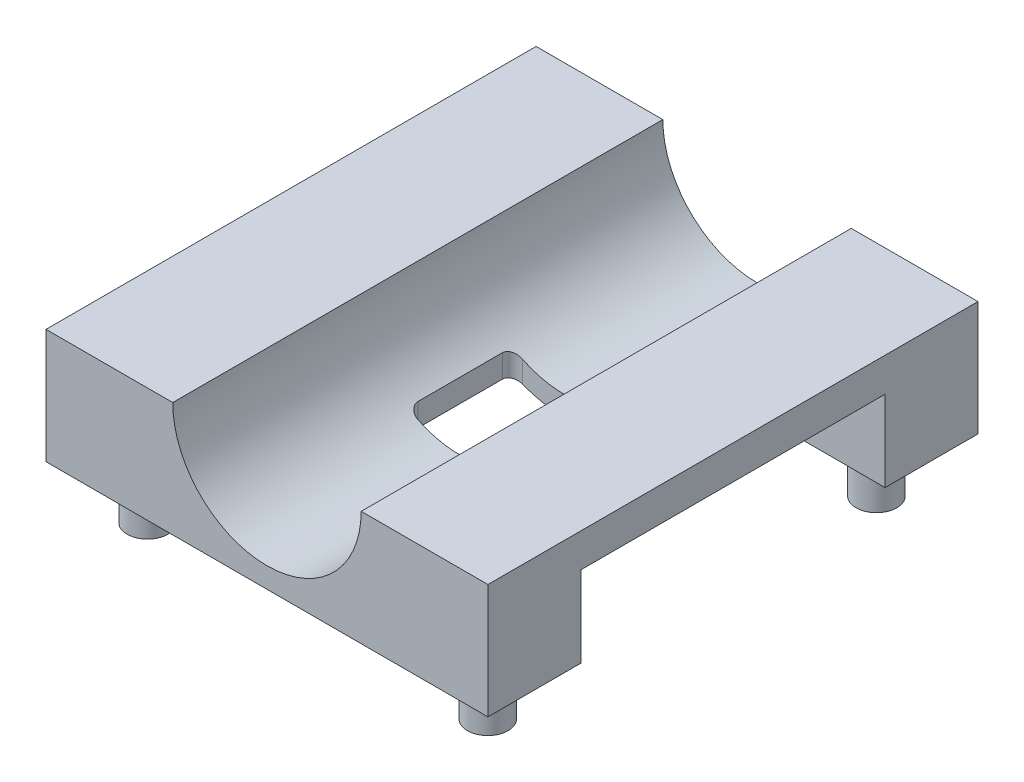
ISO-10303-21;
HEADER;
FILE_DESCRIPTION(('STEP AP214'),'2;1');
FILE_NAME('part.step','',(''),(''),'','','');
FILE_SCHEMA(('AUTOMOTIVE_DESIGN { 1 0 10303 214 1 1 1 1 }'));
ENDSEC;
DATA;
#1=APPLICATION_CONTEXT('core data for automotive mechanical design processes');
#2=APPLICATION_PROTOCOL_DEFINITION('international standard','automotive_design',2000,#1);
#3=PRODUCT_CONTEXT('',#1,'mechanical');
#4=PRODUCT('Part','Part','',(#3));
#5=PRODUCT_RELATED_PRODUCT_CATEGORY('part','',(#4));
#6=PRODUCT_DEFINITION_FORMATION('','',#4);
#7=PRODUCT_DEFINITION_CONTEXT('part definition',#1,'design');
#8=PRODUCT_DEFINITION('design','',#6,#7);
#9=PRODUCT_DEFINITION_SHAPE('','',#8);
#10=(LENGTH_UNIT() NAMED_UNIT(*) SI_UNIT(.MILLI.,.METRE.));
#11=(NAMED_UNIT(*) PLANE_ANGLE_UNIT() SI_UNIT($,.RADIAN.));
#12=(NAMED_UNIT(*) SI_UNIT($,.STERADIAN.) SOLID_ANGLE_UNIT());
#13=UNCERTAINTY_MEASURE_WITH_UNIT(LENGTH_MEASURE(1.E-05),#10,'distance_accuracy_value','');
#14=(GEOMETRIC_REPRESENTATION_CONTEXT(3) GLOBAL_UNCERTAINTY_ASSIGNED_CONTEXT((#13)) GLOBAL_UNIT_ASSIGNED_CONTEXT((#10,
#11,#12)) REPRESENTATION_CONTEXT('',''));
#15=CARTESIAN_POINT('',(0.,0.,0.));
#16=DIRECTION('',(0.,0.,1.));
#17=DIRECTION('',(1.,0.,0.));
#18=AXIS2_PLACEMENT_3D('',#15,#16,#17);
#19=CARTESIAN_POINT('',(13.075,3.1518362466727,-14.5));
#20=DIRECTION('',(0.,1.,0.));
#21=DIRECTION('',(0.,0.,1.));
#22=AXIS2_PLACEMENT_3D('',#19,#20,#21);
#23=PLANE('',#22);
#24=CARTESIAN_POINT('',(-10.105,3.1518362466727,-11.46));
#25=DIRECTION('',(0.,1.,0.));
#26=DIRECTION('',(0.,0.,1.));
#27=AXIS2_PLACEMENT_3D('',#24,#25,#26);
#28=CIRCLE('',#27,1.205);
#29=CARTESIAN_POINT('',(-10.105,3.1518362466727,-10.255));
#30=VERTEX_POINT('',#29);
#31=EDGE_CURVE('E425',#30,#30,#28,.F.);
#32=ORIENTED_EDGE('',*,*,#31,.F.);
#33=EDGE_LOOP('',(#32));
#34=FACE_BOUND('',#33,.T.);
#35=CARTESIAN_POINT('',(10.105,3.1518362466727,-11.46));
#36=DIRECTION('',(0.,1.,0.));
#37=DIRECTION('',(0.,0.,1.));
#38=AXIS2_PLACEMENT_3D('',#35,#36,#37);
#39=CIRCLE('',#38,1.205);
#40=CARTESIAN_POINT('',(10.105,3.1518362466727,-10.255));
#41=VERTEX_POINT('',#40);
#42=EDGE_CURVE('E428',#41,#41,#39,.F.);
#43=ORIENTED_EDGE('',*,*,#42,.F.);
#44=EDGE_LOOP('',(#43));
#45=FACE_BOUND('',#44,.T.);
#46=DIRECTION('',(1.,0.,0.));
#47=VECTOR('',#46,1.);
#48=CARTESIAN_POINT('',(-13.075,3.1518362466727,-9.));
#49=LINE('',#48,#47);
#50=CARTESIAN_POINT('',(-13.075,3.1518362466727,-9.));
#51=VERTEX_POINT('',#50);
#52=CARTESIAN_POINT('',(13.075,3.1518362466727,-9.));
#53=VERTEX_POINT('',#52);
#54=EDGE_CURVE('E54',#51,#53,#49,.T.);
#55=ORIENTED_EDGE('',*,*,#54,.F.);
#56=DIRECTION('',(0.,0.,1.));
#57=VECTOR('',#56,1.);
#58=CARTESIAN_POINT('',(-13.075,3.1518362466727,-14.5));
#59=LINE('',#58,#57);
#60=CARTESIAN_POINT('',(-13.075,3.1518362466727,-14.5));
#61=VERTEX_POINT('',#60);
#62=EDGE_CURVE('E410',#61,#51,#59,.T.);
#63=ORIENTED_EDGE('',*,*,#62,.F.);
#64=DIRECTION('',(-1.,0.,0.));
#65=VECTOR('',#64,1.);
#66=CARTESIAN_POINT('',(13.075,3.1518362466727,-14.5));
#67=LINE('',#66,#65);
#68=CARTESIAN_POINT('',(13.075,3.1518362466727,-14.5));
#69=VERTEX_POINT('',#68);
#70=EDGE_CURVE('E407',#69,#61,#67,.T.);
#71=ORIENTED_EDGE('',*,*,#70,.F.);
#72=DIRECTION('',(0.,0.,1.));
#73=VECTOR('',#72,1.);
#74=CARTESIAN_POINT('',(13.075,3.1518362466727,-14.5));
#75=LINE('',#74,#73);
#76=EDGE_CURVE('E414',#69,#53,#75,.T.);
#77=ORIENTED_EDGE('',*,*,#76,.T.);
#78=EDGE_LOOP('',(#55,#63,#71,#77));
#79=FACE_BOUND('',#78,.T.);
#80=ADVANCED_FACE('F33',(#34,#45,#79),#23,.F.);
#81=CARTESIAN_POINT('',(-3.04509723372467,-0.0642501067480324,-14.5));
#82=DIRECTION('',(-1.,0.,0.));
#83=DIRECTION('',(0.,0.,1.));
#84=AXIS2_PLACEMENT_3D('',#81,#82,#83);
#85=PLANE('',#84);
#86=DIRECTION('',(0.,0.,-1.));
#87=VECTOR('',#86,1.);
#88=CARTESIAN_POINT('',(-3.04509723372467,3.9080780868161,9.));
#89=LINE('',#88,#87);
#90=CARTESIAN_POINT('',(-3.04509723372467,3.9080780868161,-2.47741560380553));
#91=VERTEX_POINT('',#90);
#92=CARTESIAN_POINT('',(-3.04509723372467,3.9080780868161,2.51686965000823));
#93=VERTEX_POINT('',#92);
#94=EDGE_CURVE('E62',#91,#93,#89,.F.);
#95=ORIENTED_EDGE('',*,*,#94,.F.);
#96=DIRECTION('',(0.,1.,0.));
#97=VECTOR('',#96,1.);
#98=CARTESIAN_POINT('',(-3.04509723372467,-0.0642501067480324,-2.47741560380554));
#99=LINE('',#98,#97);
#100=CARTESIAN_POINT('',(-3.04509723372467,5.2658454148753,-2.47741560380554));
#101=VERTEX_POINT('',#100);
#102=EDGE_CURVE('E315',#91,#101,#99,.T.);
#103=ORIENTED_EDGE('',*,*,#102,.T.);
#104=DIRECTION('',(0.,0.,1.));
#105=VECTOR('',#104,1.);
#106=CARTESIAN_POINT('',(-3.04509723372467,5.2658454148753,-14.5));
#107=LINE('',#106,#105);
#108=CARTESIAN_POINT('',(-3.04509723372467,5.2658454148753,2.51686965000823));
#109=VERTEX_POINT('',#108);
#110=EDGE_CURVE('E359',#109,#101,#107,.F.);
#111=ORIENTED_EDGE('',*,*,#110,.F.);
#112=DIRECTION('',(0.,1.,0.));
#113=VECTOR('',#112,1.);
#114=CARTESIAN_POINT('',(-3.04509723372467,-0.0642501067480324,2.51686965000823));
#115=LINE('',#114,#113);
#116=EDGE_CURVE('E336',#93,#109,#115,.T.);
#117=ORIENTED_EDGE('',*,*,#116,.F.);
#118=EDGE_LOOP('',(#95,#103,#111,#117));
#119=FACE_BOUND('',#118,.T.);
#120=ADVANCED_FACE('F485',(#119),#85,.F.);
#121=CARTESIAN_POINT('',(-2.44509723372467,-0.0642501067480324,-2.47741560380554));
#122=DIRECTION('',(0.,1.,0.));
#123=DIRECTION('',(0.,0.,1.));
#124=AXIS2_PLACEMENT_3D('',#121,#122,#123);
#125=CYLINDRICAL_SURFACE('',#124,0.6);
#126=ORIENTED_EDGE('',*,*,#102,.F.);
#127=CARTESIAN_POINT('',(-3.04509723372467,3.9080780868161,-2.47741560380553));
#128=CARTESIAN_POINT('',(-3.04513505100854,3.90810422093181,-2.50873542246588));
#129=CARTESIAN_POINT('',(-3.04264767860765,3.90684059379633,-2.54002143175839));
#130=CARTESIAN_POINT('',(-3.03293029615708,3.90194265067985,-2.6015343220606));
#131=CARTESIAN_POINT('',(-3.02571919260857,3.89831778575885,-2.63176492135539));
#132=CARTESIAN_POINT('',(-3.00686507969512,3.88890687623194,-2.690415613318));
#133=CARTESIAN_POINT('',(-2.99522552396408,3.88312251582576,-2.71883709675656));
#134=CARTESIAN_POINT('',(-2.96798035700584,3.86971587889807,-2.7732524350038));
#135=CARTESIAN_POINT('',(-2.95237170533693,3.8620921936311,-2.79924440776849));
#136=CARTESIAN_POINT('',(-2.91686796757146,3.84495920216646,-2.84946909456308));
#137=CARTESIAN_POINT('',(-2.89680163677029,3.83537634802099,-2.87355523977421));
#138=CARTESIAN_POINT('',(-2.85349088794498,3.81499770648591,-2.91807423054141));
#139=CARTESIAN_POINT('',(-2.83024537318453,3.80420150075146,-2.93850580972856));
#140=CARTESIAN_POINT('',(-2.77870752645528,3.78066194716055,-2.97726018506469));
#141=CARTESIAN_POINT('',(-2.75014301871532,3.76783182042962,-2.99516857229988));
#142=CARTESIAN_POINT('',(-2.69062347560449,3.74163584220398,-3.02590390428281));
#143=CARTESIAN_POINT('',(-2.65966780957357,3.72826984982664,-3.03872950295629));
#144=CARTESIAN_POINT('',(-2.59842503841266,3.70240017471671,-3.05831743686993));
#145=CARTESIAN_POINT('',(-2.56825330165747,3.68990454768406,-3.06545318169207));
#146=CARTESIAN_POINT('',(-2.50712151136663,3.66511215666269,-3.07500369946481));
#147=CARTESIAN_POINT('',(-2.47616209643355,3.65281524401326,-3.0774221806384));
#148=CARTESIAN_POINT('',(-2.44509723372467,3.64075632005657,-3.07741560380554));
#149=B_SPLINE_CURVE_WITH_KNOTS('',3,(#127,#128,#129,#130,#131,#132,#133,#134,#135,#136,#137,
#138,#139,#140,#141,#142,#143,#144,#145,#146,#147,#148),.UNSPECIFIED.,.F.,.F.,(4,2,2,2,2,2,2,2,
2,2,4),(0.,0.0937824186535617,0.18719175258634,0.280528387853621,0.373936738195387,
0.471877687810948,0.569852510150105,0.677612391961076,0.785400792767965,0.885342772786439,
0.985206157081653),.UNSPECIFIED.);
#150=CARTESIAN_POINT('',(-2.44509723372467,3.64075632005657,-3.07741560380554));
#151=VERTEX_POINT('',#150);
#152=EDGE_CURVE('E338',#91,#151,#149,.T.);
#153=ORIENTED_EDGE('',*,*,#152,.T.);
#154=DIRECTION('',(0.,1.,0.));
#155=VECTOR('',#154,1.);
#156=CARTESIAN_POINT('',(-2.44509723372467,-0.0642501067480324,-3.07741560380554));
#157=LINE('',#156,#155);
#158=CARTESIAN_POINT('',(-2.44509723372467,4.92554784965811,-3.07741560380554));
#159=VERTEX_POINT('',#158);
#160=EDGE_CURVE('E318',#151,#159,#157,.T.);
#161=ORIENTED_EDGE('',*,*,#160,.T.);
#162=CARTESIAN_POINT('',(-2.44509723372467,4.92554784965811,-3.07741560380554));
#163=CARTESIAN_POINT('',(-2.48300653858772,4.9440286146171,-3.07741720750608));
#164=CARTESIAN_POINT('',(-2.52067135893824,4.96296176550388,-3.07382426608874));
#165=CARTESIAN_POINT('',(-2.59458004756904,5.00113155262164,-3.05971359453192));
#166=CARTESIAN_POINT('',(-2.63082224676885,5.02036851026287,-3.04918797367395));
#167=CARTESIAN_POINT('',(-2.70086552357556,5.0585011125975,-3.0214764041093));
#168=CARTESIAN_POINT('',(-2.73466641225009,5.07739673079005,-3.00428994057559));
#169=CARTESIAN_POINT('',(-2.79886471367591,5.11409617139655,-2.96351606727367));
#170=CARTESIAN_POINT('',(-2.82926174623108,5.1318998717477,-2.93992794347285));
#171=CARTESIAN_POINT('',(-2.88476999188179,5.16503245736171,-2.8874244756521));
#172=CARTESIAN_POINT('',(-2.91000472372295,5.18041640991648,-2.85867557824696));
#173=CARTESIAN_POINT('',(-2.955011883936,5.20825256579134,-2.79595690208967));
#174=CARTESIAN_POINT('',(-2.97479463910791,5.22071030505909,-2.76199718605209));
#175=CARTESIAN_POINT('',(-3.00314144903064,5.23873299484613,-2.69971969845568));
#176=CARTESIAN_POINT('',(-3.01329379560715,5.24525120849709,-2.67239190678026));
#177=CARTESIAN_POINT('',(-3.02957414075903,5.25574981173803,-2.61612162427177));
#178=CARTESIAN_POINT('',(-3.03571070642021,5.25973560335052,-2.58718271468676));
#179=CARTESIAN_POINT('',(-3.04148063511723,5.26348872929292,-2.54455830693254));
#180=CARTESIAN_POINT('',(-3.04283525142465,5.26437105419791,-2.53117869023291));
#181=CARTESIAN_POINT('',(-3.04464343017526,5.26554945941841,-2.50434025397009));
#182=CARTESIAN_POINT('',(-3.04509746973639,5.26584585015661,-2.49088148013652));
#183=CARTESIAN_POINT('',(-3.04509723372471,5.26584541487513,-2.47741560380553));
#184=B_SPLINE_CURVE_WITH_KNOTS('',3,(#162,#163,#164,#165,#166,#167,#168,#169,#170,#171,#172,
#173,#174,#175,#176,#177,#178,#179,#180,#181,#182,#183),.UNSPECIFIED.,.F.,.F.,(4,2,2,2,2,2,2,2,
2,2,4),(0.,0.126341091013564,0.252826231488759,0.379321150149909,0.505830183687303,
0.628819978592956,0.751575187102049,0.840825389762778,0.929884563925778,0.970278822445095,
1.01065167470571),.UNSPECIFIED.);
#185=EDGE_CURVE('E358',#159,#101,#184,.T.);
#186=ORIENTED_EDGE('',*,*,#185,.T.);
#187=EDGE_LOOP('',(#126,#153,#161,#186));
#188=FACE_BOUND('',#187,.T.);
#189=ADVANCED_FACE('F247',(#188),#125,.F.);
#190=CARTESIAN_POINT('',(-13.075,-0.0642501067480324,-3.07741560380554));
#191=DIRECTION('',(0.,0.,1.));
#192=DIRECTION('',(1.,0.,0.));
#193=AXIS2_PLACEMENT_3D('',#190,#191,#192);
#194=PLANE('',#193);
#195=ORIENTED_EDGE('',*,*,#160,.F.);
#196=CARTESIAN_POINT('',(0.,9.93574989325197,-3.07741560380554));
#197=DIRECTION('',(0.,0.,1.));
#198=DIRECTION('',(1.,0.,0.));
#199=AXIS2_PLACEMENT_3D('',#196,#197,#198);
#200=CIRCLE('',#199,6.75318032995857);
#201=CARTESIAN_POINT('',(2.39137183527856,3.62015132190691,-3.07741560380554));
#202=VERTEX_POINT('',#201);
#203=EDGE_CURVE('E262',#151,#202,#200,.T.);
#204=ORIENTED_EDGE('',*,*,#203,.T.);
#205=DIRECTION('',(0.,1.,0.));
#206=VECTOR('',#205,1.);
#207=CARTESIAN_POINT('',(2.39137183527856,-0.0642501067480324,-3.07741560380554));
#208=LINE('',#207,#206);
#209=CARTESIAN_POINT('',(2.39137183527856,4.8996833979169,-3.07741560380554));
#210=VERTEX_POINT('',#209);
#211=EDGE_CURVE('E324',#202,#210,#208,.T.);
#212=ORIENTED_EDGE('',*,*,#211,.T.);
#213=CARTESIAN_POINT('',(0.,9.93574989325197,-3.07741560380554));
#214=DIRECTION('',(0.,0.,1.));
#215=DIRECTION('',(1.,0.,0.));
#216=AXIS2_PLACEMENT_3D('',#213,#214,#215);
#217=CIRCLE('',#216,5.575);
#218=EDGE_CURVE('E280',#210,#159,#217,.F.);
#219=ORIENTED_EDGE('',*,*,#218,.T.);
#220=EDGE_LOOP('',(#195,#204,#212,#219));
#221=FACE_BOUND('',#220,.T.);
#222=ADVANCED_FACE('F267',(#221),#194,.T.);
#223=CARTESIAN_POINT('',(2.39137183527856,-0.0642501067480324,-2.47741560380554));
#224=DIRECTION('',(0.,1.,0.));
#225=DIRECTION('',(0.,0.,1.));
#226=AXIS2_PLACEMENT_3D('',#223,#224,#225);
#227=CYLINDRICAL_SURFACE('',#226,0.6);
#228=ORIENTED_EDGE('',*,*,#211,.F.);
#229=CARTESIAN_POINT('',(2.39137183527856,3.62015132190691,-3.07741560380554));
#230=CARTESIAN_POINT('',(2.42763334414463,3.63386807840735,-3.07742957560648));
#231=CARTESIAN_POINT('',(2.46375365430434,3.64791496614628,-3.07412986564736));
#232=CARTESIAN_POINT('',(2.53476728686477,3.67621192264573,-3.06114200874914));
#233=CARTESIAN_POINT('',(2.56966001373208,3.69046208543466,-3.05145080494139));
#234=CARTESIAN_POINT('',(2.63724798320311,3.71869894000153,-3.02591531318924));
#235=CARTESIAN_POINT('',(2.66994252993061,3.73268554734678,-3.01006908741318));
#236=CARTESIAN_POINT('',(2.73218290621409,3.75984743857264,-2.97255890418401));
#237=CARTESIAN_POINT('',(2.76172949006539,3.77302291649016,-2.95089634480366));
#238=CARTESIAN_POINT('',(2.8162514277176,3.79774895099371,-2.90259948267919));
#239=CARTESIAN_POINT('',(2.84129553221012,3.80932318447142,-2.87605528680823));
#240=CARTESIAN_POINT('',(2.88645388092285,3.83046924222881,-2.81834616610662));
#241=CARTESIAN_POINT('',(2.90656941381143,3.84004158984339,-2.78718245256409));
#242=CARTESIAN_POINT('',(2.93952317433865,3.85586860994002,-2.72379429200529));
#243=CARTESIAN_POINT('',(2.95281766722834,3.86232867411596,-2.69185838281739));
#244=CARTESIAN_POINT('',(2.97375732772188,3.87255349908247,-2.62580877404026));
#245=CARTESIAN_POINT('',(2.98141506190433,3.87632425482433,-2.59170010413997));
#246=CARTESIAN_POINT('',(2.98782288108357,3.87948358922535,-2.54393710361735));
#247=CARTESIAN_POINT('',(2.98915325387299,3.88014022772818,-2.53066762231387));
#248=CARTESIAN_POINT('',(2.99092682156053,3.88101602202,-2.5040731303545));
#249=CARTESIAN_POINT('',(2.99137120971794,3.88123576622461,-2.49074821863949));
#250=CARTESIAN_POINT('',(2.99137183527857,3.88123594809982,-2.47741560380554));
#251=B_SPLINE_CURVE_WITH_KNOTS('',3,(#229,#230,#231,#232,#233,#234,#235,#236,#237,#238,#239,
#240,#241,#242,#243,#244,#245,#246,#247,#248,#249,#250),.UNSPECIFIED.,.F.,.F.,(4,2,2,2,2,2,2,2,
2,2,4),(0.,0.116146796863037,0.232349183739063,0.348588185175548,0.464799271205039,
0.579048481057129,0.693267786334209,0.798269907534175,0.90303722228244,0.943064557543855,
0.983037946787917),.UNSPECIFIED.);
#252=CARTESIAN_POINT('',(2.99137183527856,3.88123594809985,-2.47741560380554));
#253=VERTEX_POINT('',#252);
#254=EDGE_CURVE('E254',#202,#253,#251,.T.);
#255=ORIENTED_EDGE('',*,*,#254,.T.);
#256=DIRECTION('',(0.,1.,0.));
#257=VECTOR('',#256,1.);
#258=CARTESIAN_POINT('',(2.99137183527856,-0.0642501067480324,-2.47741560380554));
#259=LINE('',#258,#257);
#260=CARTESIAN_POINT('',(2.99137183527856,5.23124996838193,-2.47741560380554));
#261=VERTEX_POINT('',#260);
#262=EDGE_CURVE('E329',#253,#261,#259,.T.);
#263=ORIENTED_EDGE('',*,*,#262,.T.);
#264=CARTESIAN_POINT('',(2.99137183527856,5.23124996838193,-2.47741560380554));
#265=CARTESIAN_POINT('',(2.99141248670441,5.23128430213802,-2.50766694784893));
#266=CARTESIAN_POINT('',(2.98908704122792,5.22979708099143,-2.53787265892649));
#267=CARTESIAN_POINT('',(2.98004465900356,5.22406146548978,-2.5971906608469));
#268=CARTESIAN_POINT('',(2.97335126528078,5.21982787465235,-2.626307933783));
#269=CARTESIAN_POINT('',(2.95591943046643,5.20888370937752,-2.68274886490848));
#270=CARTESIAN_POINT('',(2.94518664798818,5.20217660025312,-2.71007496968491));
#271=CARTESIAN_POINT('',(2.92015375522904,5.18669264471618,-2.7624282533839));
#272=CARTESIAN_POINT('',(2.90584946922386,5.17791337624159,-2.78745269405396));
#273=CARTESIAN_POINT('',(2.87310847523787,5.15806616059515,-2.83637842968677));
#274=CARTESIAN_POINT('',(2.85445760452896,5.14688352862458,-2.86008907876907));
#275=CARTESIAN_POINT('',(2.81425162809436,5.12314576435093,-2.90410300230363));
#276=CARTESIAN_POINT('',(2.7926955583258,5.11059017671694,-2.9244051406537));
#277=CARTESIAN_POINT('',(2.74383745397135,5.08261862332918,-2.96413919945146));
#278=CARTESIAN_POINT('',(2.71615682935011,5.06705385993209,-2.98300150686176));
#279=CARTESIAN_POINT('',(2.65834979245887,5.03525053610873,-3.01577252074311));
#280=CARTESIAN_POINT('',(2.62822187296248,5.01901156351012,-3.02967814567945));
#281=CARTESIAN_POINT('',(2.56435517549066,4.98538903230644,-3.05300067215539));
#282=CARTESIAN_POINT('',(2.53050825524829,4.96799420402898,-3.06210646822235));
#283=CARTESIAN_POINT('',(2.46163082103502,4.93349819043173,-3.07431416353491));
#284=CARTESIAN_POINT('',(2.42660098815756,4.91639684440717,-3.07741945971873));
#285=CARTESIAN_POINT('',(2.39137183527856,4.8996833979169,-3.07741560380554));
#286=B_SPLINE_CURVE_WITH_KNOTS('',3,(#264,#265,#266,#267,#268,#269,#270,#271,#272,#273,#274,
#275,#276,#277,#278,#279,#280,#281,#282,#283,#284,#285),.UNSPECIFIED.,.F.,.F.,(4,2,2,2,2,2,2,2,
2,2,4),(0.,0.0905563797058464,0.180628652137533,0.270575212867955,0.360627433688729,
0.456774485974419,0.552953522006567,0.663312760101185,0.773740488585856,0.890644965091383,
1.00748324148537),.UNSPECIFIED.);
#287=EDGE_CURVE('E271',#261,#210,#286,.T.);
#288=ORIENTED_EDGE('',*,*,#287,.T.);
#289=EDGE_LOOP('',(#228,#255,#263,#288));
#290=FACE_BOUND('',#289,.T.);
#291=ADVANCED_FACE('F263',(#290),#227,.F.);
#292=CARTESIAN_POINT('',(2.99137183527856,-0.0642501067480324,-14.5));
#293=DIRECTION('',(-1.,0.,0.));
#294=DIRECTION('',(0.,0.,1.));
#295=AXIS2_PLACEMENT_3D('',#292,#293,#294);
#296=PLANE('',#295);
#297=ORIENTED_EDGE('',*,*,#262,.F.);
#298=DIRECTION('',(0.,0.,-1.));
#299=VECTOR('',#298,1.);
#300=CARTESIAN_POINT('',(2.99137183527856,3.88123594809985,9.));
#301=LINE('',#300,#299);
#302=CARTESIAN_POINT('',(2.99137183527856,3.88123594809985,2.51686965000823));
#303=VERTEX_POINT('',#302);
#304=EDGE_CURVE('E235',#253,#303,#301,.F.);
#305=ORIENTED_EDGE('',*,*,#304,.T.);
#306=DIRECTION('',(0.,1.,0.));
#307=VECTOR('',#306,1.);
#308=CARTESIAN_POINT('',(2.99137183527856,-0.0642501067480324,2.51686965000823));
#309=LINE('',#308,#307);
#310=CARTESIAN_POINT('',(2.99137183527856,5.23124996838193,2.51686965000823));
#311=VERTEX_POINT('',#310);
#312=EDGE_CURVE('E331',#303,#311,#309,.T.);
#313=ORIENTED_EDGE('',*,*,#312,.T.);
#314=DIRECTION('',(0.,0.,1.));
#315=VECTOR('',#314,1.);
#316=CARTESIAN_POINT('',(2.99137183527856,5.23124996838193,-14.5));
#317=LINE('',#316,#315);
#318=EDGE_CURVE('E281',#311,#261,#317,.F.);
#319=ORIENTED_EDGE('',*,*,#318,.T.);
#320=EDGE_LOOP('',(#297,#305,#313,#319));
#321=FACE_BOUND('',#320,.T.);
#322=ADVANCED_FACE('F266',(#321),#296,.T.);
#323=CARTESIAN_POINT('',(2.39137183527856,-0.0642501067480324,2.51686965000823));
#324=DIRECTION('',(0.,1.,0.));
#325=DIRECTION('',(0.,0.,1.));
#326=AXIS2_PLACEMENT_3D('',#323,#324,#325);
#327=CYLINDRICAL_SURFACE('',#326,0.6);
#328=ORIENTED_EDGE('',*,*,#312,.F.);
#329=CARTESIAN_POINT('',(2.99137183527856,3.88123594809985,2.51686965000823));
#330=CARTESIAN_POINT('',(2.99140938227915,3.88126153326827,2.5482806171982));
#331=CARTESIAN_POINT('',(2.98890795846205,3.88001860652077,2.57965863905268));
#332=CARTESIAN_POINT('',(2.97913201712646,3.87519969785145,2.64135794387782));
#333=CARTESIAN_POINT('',(2.97187601489893,3.8716327663792,2.67168284749369));
#334=CARTESIAN_POINT('',(2.95289852929619,3.86237037183736,2.73052012557278));
#335=CARTESIAN_POINT('',(2.9411803239938,3.85667647136345,2.7590338127124));
#336=CARTESIAN_POINT('',(2.91374263755211,3.84347764501758,2.81362252019478));
#337=CARTESIAN_POINT('',(2.89802021320581,3.83597138722685,2.83969572735906));
#338=CARTESIAN_POINT('',(2.86227453685133,3.81911389516413,2.89002915004321));
#339=CARTESIAN_POINT('',(2.84208392023158,3.80969254585984,2.9141466248631));
#340=CARTESIAN_POINT('',(2.79849849083639,3.78965957444604,2.95870690804757));
#341=CARTESIAN_POINT('',(2.77510256978207,3.77904754087153,2.97914843972502));
#342=CARTESIAN_POINT('',(2.72332308017674,3.75595760484121,3.01781877275745));
#343=CARTESIAN_POINT('',(2.69467632062719,3.74339837727728,3.03564684146162));
#344=CARTESIAN_POINT('',(2.63499294953646,3.71776685499894,3.06620873913333));
#345=CARTESIAN_POINT('',(2.60395580338126,3.70469444583299,3.07894142454138));
#346=CARTESIAN_POINT('',(2.54294764868284,3.67956494317659,3.09821196939948));
#347=CARTESIAN_POINT('',(2.51310953291363,3.667515787168,3.105183696366));
#348=CARTESIAN_POINT('',(2.45267140236949,3.64361784451893,3.11451401681426));
#349=CARTESIAN_POINT('',(2.42207200945041,3.63176890680766,3.11687625790633));
#350=CARTESIAN_POINT('',(2.39137183527856,3.62015132190691,3.11686965000823));
#351=B_SPLINE_CURVE_WITH_KNOTS('',3,(#329,#330,#331,#332,#333,#334,#335,#336,#337,#338,#339,
#340,#341,#342,#343,#344,#345,#346,#347,#348,#349,#350),.UNSPECIFIED.,.F.,.F.,(4,2,2,2,2,2,2,2,
2,2,4),(0.,0.0940573233572309,0.187750528004281,0.281375035090994,0.375068558283783,
0.47316423496715,0.571293915610081,0.678842788585064,0.786415785290179,0.884863725269389,
0.983233729098482),.UNSPECIFIED.);
#352=CARTESIAN_POINT('',(2.39137183527856,3.62015132190691,3.11686965000823));
#353=VERTEX_POINT('',#352);
#354=EDGE_CURVE('E227',#303,#353,#351,.T.);
#355=ORIENTED_EDGE('',*,*,#354,.T.);
#356=DIRECTION('',(0.,1.,0.));
#357=VECTOR('',#356,1.);
#358=CARTESIAN_POINT('',(2.39137183527856,-0.0642501067480324,3.11686965000823));
#359=LINE('',#358,#357);
#360=CARTESIAN_POINT('',(2.39137183527856,4.8996833979169,3.11686965000823));
#361=VERTEX_POINT('',#360);
#362=EDGE_CURVE('E333',#353,#361,#359,.T.);
#363=ORIENTED_EDGE('',*,*,#362,.T.);
#364=CARTESIAN_POINT('',(2.39137183527856,4.8996833979169,3.11686965000823));
#365=CARTESIAN_POINT('',(2.42907890871964,4.91756920233117,3.11687279876096));
#366=CARTESIAN_POINT('',(2.46655095706587,4.93590037131668,3.11331656257605));
#367=CARTESIAN_POINT('',(2.54009396378089,4.97286853827507,3.09934946487906));
#368=CARTESIAN_POINT('',(2.57616335564515,4.99150584688886,3.08893116008305));
#369=CARTESIAN_POINT('',(2.64588877529712,5.02846250810962,3.06150329840153));
#370=CARTESIAN_POINT('',(2.67954446124577,5.04678181540255,3.04449281007953));
#371=CARTESIAN_POINT('',(2.7434779617375,5.08237083084865,3.00415689034708));
#372=CARTESIAN_POINT('',(2.77375616189992,5.09964065872183,2.98083218089746));
#373=CARTESIAN_POINT('',(2.82914064955387,5.13183589614511,2.92889216401954));
#374=CARTESIAN_POINT('',(2.8543606116877,5.14681045464289,2.90042958909087));
#375=CARTESIAN_POINT('',(2.8994293133198,5.17396153248168,2.83834104303599));
#376=CARTESIAN_POINT('',(2.91928228218249,5.18614025388463,2.80471917055217));
#377=CARTESIAN_POINT('',(2.95023384409975,5.2053128028922,2.73789215943203));
#378=CARTESIAN_POINT('',(2.96213057369218,5.21277236309467,2.70519093818732));
#379=CARTESIAN_POINT('',(2.98011142612991,5.22409653554995,2.63768211839177));
#380=CARTESIAN_POINT('',(2.98621489173714,5.22797310966187,2.60288194483332));
#381=CARTESIAN_POINT('',(2.98992943701891,5.23033315127548,2.55931997792807));
#382=CARTESIAN_POINT('',(2.99047030230915,5.23067686477349,2.55083738271637));
#383=CARTESIAN_POINT('',(2.9911908626956,5.23113484457447,2.53386114494688));
#384=CARTESIAN_POINT('',(2.99137100196418,5.23124939305477,2.5253675288773));
#385=CARTESIAN_POINT('',(2.99137183527857,5.23124996838192,2.51686965000823));
#386=B_SPLINE_CURVE_WITH_KNOTS('',3,(#364,#365,#366,#367,#368,#369,#370,#371,#372,#373,#374,
#375,#376,#377,#378,#379,#380,#381,#382,#383,#384,#385),.UNSPECIFIED.,.F.,.F.,(4,2,2,2,2,2,2,2,
2,2,4),(0.,0.12502208303728,0.250180001318674,0.375355610124422,0.500516912534773,
0.622435390109001,0.744257510047151,0.850391531870256,0.956169929919554,0.981683813077274,
1.0071662608889),.UNSPECIFIED.);
#387=EDGE_CURVE('E303',#361,#311,#386,.T.);
#388=ORIENTED_EDGE('',*,*,#387,.T.);
#389=EDGE_LOOP('',(#328,#355,#363,#388));
#390=FACE_BOUND('',#389,.T.);
#391=ADVANCED_FACE('F237',(#390),#327,.F.);
#392=CARTESIAN_POINT('',(-13.075,-0.0642501067480324,3.11686965000823));
#393=DIRECTION('',(0.,0.,1.));
#394=DIRECTION('',(1.,0.,0.));
#395=AXIS2_PLACEMENT_3D('',#392,#393,#394);
#396=PLANE('',#395);
#397=CARTESIAN_POINT('',(0.,9.93574989325197,3.11686965000823));
#398=DIRECTION('',(0.,0.,1.));
#399=DIRECTION('',(1.,0.,0.));
#400=AXIS2_PLACEMENT_3D('',#397,#398,#399);
#401=CIRCLE('',#400,6.75318032995857);
#402=CARTESIAN_POINT('',(-2.44509723372466,3.64075632005657,3.11686965000823));
#403=VERTEX_POINT('',#402);
#404=EDGE_CURVE('E186',#403,#353,#401,.T.);
#405=ORIENTED_EDGE('',*,*,#404,.F.);
#406=DIRECTION('',(0.,1.,0.));
#407=VECTOR('',#406,1.);
#408=CARTESIAN_POINT('',(-2.44509723372467,-0.0642501067480324,3.11686965000823));
#409=LINE('',#408,#407);
#410=CARTESIAN_POINT('',(-2.44509723372467,4.92554784965811,3.11686965000823));
#411=VERTEX_POINT('',#410);
#412=EDGE_CURVE('E335',#403,#411,#409,.T.);
#413=ORIENTED_EDGE('',*,*,#412,.T.);
#414=CARTESIAN_POINT('',(0.,9.93574989325197,3.11686965000823));
#415=DIRECTION('',(0.,0.,1.));
#416=DIRECTION('',(1.,0.,0.));
#417=AXIS2_PLACEMENT_3D('',#414,#415,#416);
#418=CIRCLE('',#417,5.575);
#419=EDGE_CURVE('E309',#361,#411,#418,.F.);
#420=ORIENTED_EDGE('',*,*,#419,.F.);
#421=ORIENTED_EDGE('',*,*,#362,.F.);
#422=EDGE_LOOP('',(#405,#413,#420,#421));
#423=FACE_BOUND('',#422,.T.);
#424=ADVANCED_FACE('F529',(#423),#396,.F.);
#425=CARTESIAN_POINT('',(-2.44509723372467,-0.0642501067480324,2.51686965000823));
#426=DIRECTION('',(0.,1.,0.));
#427=DIRECTION('',(0.,0.,1.));
#428=AXIS2_PLACEMENT_3D('',#425,#426,#427);
#429=CYLINDRICAL_SURFACE('',#428,0.6);
#430=ORIENTED_EDGE('',*,*,#412,.F.);
#431=CARTESIAN_POINT('',(-2.44509723372466,3.64075632005657,3.11686965000823));
#432=CARTESIAN_POINT('',(-2.48147650030793,3.65487301724493,3.11688283880143));
#433=CARTESIAN_POINT('',(-2.51771015336205,3.66932304313461,3.11356249584387));
#434=CARTESIAN_POINT('',(-2.58894279654731,3.69842235222529,3.10049274640515));
#435=CARTESIAN_POINT('',(-2.62394107466851,3.71307174380373,3.09073969416451));
#436=CARTESIAN_POINT('',(-2.69172706002534,3.74208999292477,3.0650388919685));
#437=CARTESIAN_POINT('',(-2.72451404685117,3.75645875797016,3.04908913453929));
#438=CARTESIAN_POINT('',(-2.78692006216632,3.78435279390065,3.01132504513616));
#439=CARTESIAN_POINT('',(-2.81653988276174,3.79787827533594,2.98951218433829));
#440=CARTESIAN_POINT('',(-2.87113732221294,3.82322941497416,2.94089970470922));
#441=CARTESIAN_POINT('',(-2.89618995822094,3.83508164505802,2.91419862283975));
#442=CARTESIAN_POINT('',(-2.94133110679862,3.85671674564556,2.85613576202474));
#443=CARTESIAN_POINT('',(-2.96142107855681,3.86650022430891,2.82477535742886));
#444=CARTESIAN_POINT('',(-2.99420360151343,3.88261055558562,2.76111267819479));
#445=CARTESIAN_POINT('',(-3.00737864810486,3.88916002440992,2.72911525806094));
#446=CARTESIAN_POINT('',(-3.02806799373471,3.89949398408686,2.66294998790884));
#447=CARTESIAN_POINT('',(-3.03559532488507,3.90328483983037,2.62878733312605));
#448=CARTESIAN_POINT('',(-3.04176065771459,3.90639347613412,2.5813761090664));
#449=CARTESIAN_POINT('',(-3.04301145895235,3.90702476445654,2.56850636126241));
#450=CARTESIAN_POINT('',(-3.04467884047299,3.90786666380448,2.54271670644469));
#451=CARTESIAN_POINT('',(-3.04509654419763,3.90807784135332,2.52979689055228));
#452=CARTESIAN_POINT('',(-3.04509723372467,3.90807808681608,2.51686965000823));
#453=B_SPLINE_CURVE_WITH_KNOTS('',3,(#431,#432,#433,#434,#435,#436,#437,#438,#439,#440,#441,
#442,#443,#444,#445,#446,#447,#448,#449,#450,#451,#452),.UNSPECIFIED.,.F.,.F.,(4,2,2,2,2,2,2,2,
2,2,4),(0.,0.11690542405907,0.233877161657396,0.350886824856235,0.467867155231593,
0.582707263615067,0.69751356488271,0.802594015010588,0.907431239749439,0.946242158273164,
0.985000704336054),.UNSPECIFIED.);
#454=EDGE_CURVE('E11',#403,#93,#453,.T.);
#455=ORIENTED_EDGE('',*,*,#454,.T.);
#456=ORIENTED_EDGE('',*,*,#116,.T.);
#457=CARTESIAN_POINT('',(-3.04509723372467,5.2658454148753,2.51686965000823));
#458=CARTESIAN_POINT('',(-3.04513820643402,5.2658806147206,2.54698200793448));
#459=CARTESIAN_POINT('',(-3.04283344279622,5.26436916490001,2.5770473251724));
#460=CARTESIAN_POINT('',(-3.03387687683518,5.25854294928693,2.63608068910435));
#461=CARTESIAN_POINT('',(-3.02724909974524,5.2542436776379,2.66505386951208));
#462=CARTESIAN_POINT('',(-3.00999694564391,5.24313427219911,2.72120871440212));
#463=CARTESIAN_POINT('',(-2.99937846447294,5.23632784276168,2.74839295257334));
#464=CARTESIAN_POINT('',(-2.9746240052875,5.22061966951264,2.80047760777817));
#465=CARTESIAN_POINT('',(-2.96048374033508,5.2117153727634,2.82537519041785));
#466=CARTESIAN_POINT('',(-2.92809886310854,5.19156935724817,2.87411562656337));
#467=CARTESIAN_POINT('',(-2.90963664580694,5.18020786156965,2.89776352920144));
#468=CARTESIAN_POINT('',(-2.86984741631067,5.15609061725823,2.94168292447895));
#469=CARTESIAN_POINT('',(-2.84851947594281,5.14333441714776,2.96195331839905));
#470=CARTESIAN_POINT('',(-2.80004486467254,5.11482899645091,3.00178333118623));
#471=CARTESIAN_POINT('',(-2.77250770027945,5.0989210980669,3.02075483545157));
#472=CARTESIAN_POINT('',(-2.71499097362744,5.06640239137128,3.05376671226278));
#473=CARTESIAN_POINT('',(-2.68500976133105,5.04979111188714,3.0678037188678));
#474=CARTESIAN_POINT('',(-2.62081680535772,5.01504205904822,3.09166046908409));
#475=CARTESIAN_POINT('',(-2.58645782953987,4.9968870720904,3.10106115863902));
#476=CARTESIAN_POINT('',(-2.51650169322398,4.96086952331195,3.11366545293831));
#477=CARTESIAN_POINT('',(-2.48090526031275,4.943006798442,3.11687263857395));
#478=CARTESIAN_POINT('',(-2.44509723372467,4.92554784965811,3.11686965000823));
#479=B_SPLINE_CURVE_WITH_KNOTS('',3,(#457,#458,#459,#460,#461,#462,#463,#464,#465,#466,#467,
#468,#469,#470,#471,#472,#473,#474,#475,#476,#477,#478),.UNSPECIFIED.,.F.,.F.,(4,2,2,2,2,2,2,2,
2,2,4),(0.,0.0901369728891897,0.179777227619944,0.269285565724604,0.358903396154658,
0.454777119954153,0.550681971288962,0.661327494621103,0.77204834616881,0.891486625504973,
1.01085582864465),.UNSPECIFIED.);
#480=EDGE_CURVE('E295',#109,#411,#479,.T.);
#481=ORIENTED_EDGE('',*,*,#480,.T.);
#482=EDGE_LOOP('',(#430,#455,#456,#481));
#483=FACE_BOUND('',#482,.T.);
#484=ADVANCED_FACE('F441',(#483),#429,.F.);
#485=CARTESIAN_POINT('',(-10.105,3.1518362466727,11.46));
#486=DIRECTION('',(0.,1.,0.));
#487=DIRECTION('',(0.,0.,1.));
#488=AXIS2_PLACEMENT_3D('',#485,#486,#487);
#489=CIRCLE('',#488,1.205);
#490=CARTESIAN_POINT('',(-10.105,3.1518362466727,12.665));
#491=VERTEX_POINT('',#490);
#492=EDGE_CURVE('E47',#491,#491,#489,.F.);
#493=ORIENTED_EDGE('',*,*,#492,.F.);
#494=EDGE_LOOP('',(#493));
#495=FACE_BOUND('',#494,.T.);
#496=CARTESIAN_POINT('',(10.026555831626,3.1518362466727,11.46));
#497=DIRECTION('',(0.,1.,0.));
#498=DIRECTION('',(0.,0.,1.));
#499=AXIS2_PLACEMENT_3D('',#496,#497,#498);
#500=CIRCLE('',#499,1.205);
#501=CARTESIAN_POINT('',(10.026555831626,3.1518362466727,12.665));
#502=VERTEX_POINT('',#501);
#503=EDGE_CURVE('E431',#502,#502,#500,.F.);
#504=ORIENTED_EDGE('',*,*,#503,.F.);
#505=EDGE_LOOP('',(#504));
#506=FACE_BOUND('',#505,.T.);
#507=CARTESIAN_POINT('',(-13.075,3.1518362466727,9.));
#508=VERTEX_POINT('',#507);
#509=CARTESIAN_POINT('',(-13.075,3.1518362466727,14.5));
#510=VERTEX_POINT('',#509);
#511=EDGE_CURVE('E409',#508,#510,#59,.T.);
#512=ORIENTED_EDGE('',*,*,#511,.F.);
#513=DIRECTION('',(1.,0.,0.));
#514=VECTOR('',#513,1.);
#515=CARTESIAN_POINT('',(-13.075,3.1518362466727,9.));
#516=LINE('',#515,#514);
#517=CARTESIAN_POINT('',(13.075,3.1518362466727,9.));
#518=VERTEX_POINT('',#517);
#519=EDGE_CURVE('E212',#508,#518,#516,.T.);
#520=ORIENTED_EDGE('',*,*,#519,.T.);
#521=CARTESIAN_POINT('',(13.075,3.1518362466727,14.5));
#522=VERTEX_POINT('',#521);
#523=EDGE_CURVE('E413',#518,#522,#75,.T.);
#524=ORIENTED_EDGE('',*,*,#523,.T.);
#525=DIRECTION('',(-1.,0.,0.));
#526=VECTOR('',#525,1.);
#527=CARTESIAN_POINT('',(13.075,3.1518362466727,14.5));
#528=LINE('',#527,#526);
#529=EDGE_CURVE('E393',#522,#510,#528,.T.);
#530=ORIENTED_EDGE('',*,*,#529,.T.);
#531=EDGE_LOOP('',(#512,#520,#524,#530));
#532=FACE_BOUND('',#531,.T.);
#533=ADVANCED_FACE('F438',(#495,#506,#532),#23,.F.);
#534=CARTESIAN_POINT('',(-13.075,3.1518362466727,-14.5));
#535=DIRECTION('',(1.,0.,0.));
#536=DIRECTION('',(0.,1.,0.));
#537=AXIS2_PLACEMENT_3D('',#534,#535,#536);
#538=PLANE('',#537);
#539=DIRECTION('',(0.,0.,-1.));
#540=VECTOR('',#539,1.);
#541=CARTESIAN_POINT('',(-13.075,7.93574989325197,9.));
#542=LINE('',#541,#540);
#543=CARTESIAN_POINT('',(-13.075,7.93574989325197,9.));
#544=VERTEX_POINT('',#543);
#545=CARTESIAN_POINT('',(-13.075,7.93574989325197,-9.));
#546=VERTEX_POINT('',#545);
#547=EDGE_CURVE('E187',#544,#546,#542,.T.);
#548=ORIENTED_EDGE('',*,*,#547,.F.);
#549=DIRECTION('',(0.,-1.,0.));
#550=VECTOR('',#549,1.);
#551=CARTESIAN_POINT('',(-13.075,7.93574989325197,9.));
#552=LINE('',#551,#550);
#553=EDGE_CURVE('E209',#544,#508,#552,.T.);
#554=ORIENTED_EDGE('',*,*,#553,.T.);
#555=ORIENTED_EDGE('',*,*,#511,.T.);
#556=DIRECTION('',(0.,1.,0.));
#557=VECTOR('',#556,1.);
#558=CARTESIAN_POINT('',(-13.075,3.1518362466727,14.5));
#559=LINE('',#558,#557);
#560=CARTESIAN_POINT('',(-13.075,9.93574989325197,14.5));
#561=VERTEX_POINT('',#560);
#562=EDGE_CURVE('E378',#510,#561,#559,.T.);
#563=ORIENTED_EDGE('',*,*,#562,.T.);
#564=DIRECTION('',(0.,0.,1.));
#565=VECTOR('',#564,1.);
#566=CARTESIAN_POINT('',(-13.075,9.93574989325197,-14.5));
#567=LINE('',#566,#565);
#568=CARTESIAN_POINT('',(-13.075,9.93574989325197,-14.5));
#569=VERTEX_POINT('',#568);
#570=EDGE_CURVE('E423',#569,#561,#567,.T.);
#571=ORIENTED_EDGE('',*,*,#570,.F.);
#572=DIRECTION('',(0.,1.,0.));
#573=VECTOR('',#572,1.);
#574=CARTESIAN_POINT('',(-13.075,3.1518362466727,-14.5));
#575=LINE('',#574,#573);
#576=EDGE_CURVE('E396',#61,#569,#575,.T.);
#577=ORIENTED_EDGE('',*,*,#576,.F.);
#578=ORIENTED_EDGE('',*,*,#62,.T.);
#579=DIRECTION('',(0.,-1.,0.));
#580=VECTOR('',#579,1.);
#581=CARTESIAN_POINT('',(-13.075,7.93574989325197,-9.));
#582=LINE('',#581,#580);
#583=EDGE_CURVE('E194',#546,#51,#582,.T.);
#584=ORIENTED_EDGE('',*,*,#583,.F.);
#585=EDGE_LOOP('',(#548,#554,#555,#563,#571,#577,#578,#584));
#586=FACE_BOUND('',#585,.T.);
#587=ADVANCED_FACE('F35',(#586),#538,.F.);
#588=CARTESIAN_POINT('',(-13.075,9.93574989325197,-14.5));
#589=DIRECTION('',(0.,-1.,0.));
#590=DIRECTION('',(0.,0.,-1.));
#591=AXIS2_PLACEMENT_3D('',#588,#589,#590);
#592=PLANE('',#591);
#593=ORIENTED_EDGE('',*,*,#570,.T.);
#594=DIRECTION('',(1.,0.,0.));
#595=VECTOR('',#594,1.);
#596=CARTESIAN_POINT('',(-13.075,9.93574989325197,14.5));
#597=LINE('',#596,#595);
#598=CARTESIAN_POINT('',(-5.57500000000001,9.93574989325197,14.5));
#599=VERTEX_POINT('',#598);
#600=EDGE_CURVE('E381',#561,#599,#597,.T.);
#601=ORIENTED_EDGE('',*,*,#600,.T.);
#602=DIRECTION('',(0.,0.,1.));
#603=VECTOR('',#602,1.);
#604=CARTESIAN_POINT('',(-5.57500000000001,9.93574989325197,-14.5));
#605=LINE('',#604,#603);
#606=CARTESIAN_POINT('',(-5.57500000000001,9.93574989325197,-14.5));
#607=VERTEX_POINT('',#606);
#608=EDGE_CURVE('E421',#607,#599,#605,.T.);
#609=ORIENTED_EDGE('',*,*,#608,.F.);
#610=DIRECTION('',(1.,0.,0.));
#611=VECTOR('',#610,1.);
#612=CARTESIAN_POINT('',(-13.075,9.93574989325197,-14.5));
#613=LINE('',#612,#611);
#614=EDGE_CURVE('E399',#569,#607,#613,.T.);
#615=ORIENTED_EDGE('',*,*,#614,.F.);
#616=EDGE_LOOP('',(#593,#601,#609,#615));
#617=FACE_BOUND('',#616,.T.);
#618=ADVANCED_FACE('F289',(#617),#592,.F.);
#619=CARTESIAN_POINT('',(0.,9.93574989325197,-14.5));
#620=DIRECTION('',(0.,0.,1.));
#621=DIRECTION('',(1.,0.,0.));
#622=AXIS2_PLACEMENT_3D('',#619,#620,#621);
#623=CYLINDRICAL_SURFACE('',#622,5.575);
#624=ORIENTED_EDGE('',*,*,#480,.F.);
#625=ORIENTED_EDGE('',*,*,#110,.T.);
#626=ORIENTED_EDGE('',*,*,#185,.F.);
#627=ORIENTED_EDGE('',*,*,#218,.F.);
#628=ORIENTED_EDGE('',*,*,#287,.F.);
#629=ORIENTED_EDGE('',*,*,#318,.F.);
#630=ORIENTED_EDGE('',*,*,#387,.F.);
#631=ORIENTED_EDGE('',*,*,#419,.T.);
#632=EDGE_LOOP('',(#624,#625,#626,#627,#628,#629,#630,#631));
#633=FACE_BOUND('',#632,.T.);
#634=ORIENTED_EDGE('',*,*,#608,.T.);
#635=CARTESIAN_POINT('',(0.,9.93574989325197,14.5));
#636=DIRECTION('',(0.,0.,1.));
#637=DIRECTION('',(1.,0.,0.));
#638=AXIS2_PLACEMENT_3D('',#635,#636,#637);
#639=CIRCLE('',#638,5.575);
#640=CARTESIAN_POINT('',(5.575,9.93574989325197,14.5));
#641=VERTEX_POINT('',#640);
#642=EDGE_CURVE('E384',#599,#641,#639,.T.);
#643=ORIENTED_EDGE('',*,*,#642,.T.);
#644=DIRECTION('',(0.,0.,1.));
#645=VECTOR('',#644,1.);
#646=CARTESIAN_POINT('',(5.575,9.93574989325197,-14.5));
#647=LINE('',#646,#645);
#648=CARTESIAN_POINT('',(5.575,9.93574989325197,-14.5));
#649=VERTEX_POINT('',#648);
#650=EDGE_CURVE('E419',#649,#641,#647,.T.);
#651=ORIENTED_EDGE('',*,*,#650,.F.);
#652=CARTESIAN_POINT('',(0.,9.93574989325197,-14.5));
#653=DIRECTION('',(0.,0.,1.));
#654=DIRECTION('',(1.,0.,0.));
#655=AXIS2_PLACEMENT_3D('',#652,#653,#654);
#656=CIRCLE('',#655,5.575);
#657=EDGE_CURVE('E401',#607,#649,#656,.T.);
#658=ORIENTED_EDGE('',*,*,#657,.F.);
#659=EDGE_LOOP('',(#634,#643,#651,#658));
#660=FACE_BOUND('',#659,.T.);
#661=ADVANCED_FACE('F284',(#633,#660),#623,.F.);
#662=CARTESIAN_POINT('',(5.575,9.93574989325197,-14.5));
#663=DIRECTION('',(0.,-1.,0.));
#664=DIRECTION('',(0.,0.,-1.));
#665=AXIS2_PLACEMENT_3D('',#662,#663,#664);
#666=PLANE('',#665);
#667=ORIENTED_EDGE('',*,*,#650,.T.);
#668=DIRECTION('',(1.,0.,0.));
#669=VECTOR('',#668,1.);
#670=CARTESIAN_POINT('',(5.575,9.93574989325197,14.5));
#671=LINE('',#670,#669);
#672=CARTESIAN_POINT('',(13.075,9.93574989325197,14.5));
#673=VERTEX_POINT('',#672);
#674=EDGE_CURVE('E387',#641,#673,#671,.T.);
#675=ORIENTED_EDGE('',*,*,#674,.T.);
#676=DIRECTION('',(0.,0.,1.));
#677=VECTOR('',#676,1.);
#678=CARTESIAN_POINT('',(13.075,9.93574989325197,-14.5));
#679=LINE('',#678,#677);
#680=CARTESIAN_POINT('',(13.075,9.93574989325197,-14.5));
#681=VERTEX_POINT('',#680);
#682=EDGE_CURVE('E417',#681,#673,#679,.T.);
#683=ORIENTED_EDGE('',*,*,#682,.F.);
#684=DIRECTION('',(1.,0.,0.));
#685=VECTOR('',#684,1.);
#686=CARTESIAN_POINT('',(5.575,9.93574989325197,-14.5));
#687=LINE('',#686,#685);
#688=EDGE_CURVE('E403',#649,#681,#687,.T.);
#689=ORIENTED_EDGE('',*,*,#688,.F.);
#690=EDGE_LOOP('',(#667,#675,#683,#689));
#691=FACE_BOUND('',#690,.T.);
#692=ADVANCED_FACE('F288',(#691),#666,.F.);
#693=CARTESIAN_POINT('',(13.075,9.93574989325197,-14.5));
#694=DIRECTION('',(-1.,0.,0.));
#695=DIRECTION('',(0.,-1.,0.));
#696=AXIS2_PLACEMENT_3D('',#693,#694,#695);
#697=PLANE('',#696);
#698=ORIENTED_EDGE('',*,*,#523,.F.);
#699=DIRECTION('',(0.,1.,0.));
#700=VECTOR('',#699,1.);
#701=CARTESIAN_POINT('',(13.075,3.1518362466727,9.));
#702=LINE('',#701,#700);
#703=CARTESIAN_POINT('',(13.075,7.93574989325197,9.));
#704=VERTEX_POINT('',#703);
#705=EDGE_CURVE('E215',#518,#704,#702,.T.);
#706=ORIENTED_EDGE('',*,*,#705,.T.);
#707=DIRECTION('',(0.,0.,-1.));
#708=VECTOR('',#707,1.);
#709=CARTESIAN_POINT('',(13.075,7.93574989325197,9.));
#710=LINE('',#709,#708);
#711=CARTESIAN_POINT('',(13.075,7.93574989325197,-9.));
#712=VERTEX_POINT('',#711);
#713=EDGE_CURVE('E222',#704,#712,#710,.T.);
#714=ORIENTED_EDGE('',*,*,#713,.T.);
#715=DIRECTION('',(0.,1.,0.));
#716=VECTOR('',#715,1.);
#717=CARTESIAN_POINT('',(13.075,3.1518362466727,-9.));
#718=LINE('',#717,#716);
#719=EDGE_CURVE('E203',#53,#712,#718,.T.);
#720=ORIENTED_EDGE('',*,*,#719,.F.);
#721=ORIENTED_EDGE('',*,*,#76,.F.);
#722=DIRECTION('',(0.,-1.,0.));
#723=VECTOR('',#722,1.);
#724=CARTESIAN_POINT('',(13.075,9.93574989325197,-14.5));
#725=LINE('',#724,#723);
#726=EDGE_CURVE('E405',#681,#69,#725,.T.);
#727=ORIENTED_EDGE('',*,*,#726,.F.);
#728=ORIENTED_EDGE('',*,*,#682,.T.);
#729=DIRECTION('',(0.,-1.,0.));
#730=VECTOR('',#729,1.);
#731=CARTESIAN_POINT('',(13.075,9.93574989325197,14.5));
#732=LINE('',#731,#730);
#733=EDGE_CURVE('E390',#673,#522,#732,.T.);
#734=ORIENTED_EDGE('',*,*,#733,.T.);
#735=EDGE_LOOP('',(#698,#706,#714,#720,#721,#727,#728,#734));
#736=FACE_BOUND('',#735,.T.);
#737=ADVANCED_FACE('F470',(#736),#697,.F.);
#738=CARTESIAN_POINT('',(0.,9.93574989325197,-14.5));
#739=DIRECTION('',(0.,0.,1.));
#740=DIRECTION('',(1.,0.,0.));
#741=AXIS2_PLACEMENT_3D('',#738,#739,#740);
#742=PLANE('',#741);
#743=ORIENTED_EDGE('',*,*,#576,.T.);
#744=ORIENTED_EDGE('',*,*,#614,.T.);
#745=ORIENTED_EDGE('',*,*,#657,.T.);
#746=ORIENTED_EDGE('',*,*,#688,.T.);
#747=ORIENTED_EDGE('',*,*,#726,.T.);
#748=ORIENTED_EDGE('',*,*,#70,.T.);
#749=EDGE_LOOP('',(#743,#744,#745,#746,#747,#748));
#750=FACE_BOUND('',#749,.T.);
#751=ADVANCED_FACE('F464',(#750),#742,.F.);
#752=CARTESIAN_POINT('',(0.,9.93574989325197,14.5));
#753=DIRECTION('',(0.,0.,1.));
#754=DIRECTION('',(1.,0.,0.));
#755=AXIS2_PLACEMENT_3D('',#752,#753,#754);
#756=PLANE('',#755);
#757=ORIENTED_EDGE('',*,*,#562,.F.);
#758=ORIENTED_EDGE('',*,*,#529,.F.);
#759=ORIENTED_EDGE('',*,*,#733,.F.);
#760=ORIENTED_EDGE('',*,*,#674,.F.);
#761=ORIENTED_EDGE('',*,*,#642,.F.);
#762=ORIENTED_EDGE('',*,*,#600,.F.);
#763=EDGE_LOOP('',(#757,#758,#759,#760,#761,#762));
#764=FACE_BOUND('',#763,.T.);
#765=ADVANCED_FACE('F454',(#764),#756,.T.);
#766=CARTESIAN_POINT('',(-10.105,6.56009093199186,-11.46));
#767=DIRECTION('',(0.,-1.,0.));
#768=DIRECTION('',(0.,0.,-1.));
#769=AXIS2_PLACEMENT_3D('',#766,#767,#768);
#770=CYLINDRICAL_SURFACE('',#769,1.205);
#771=CARTESIAN_POINT('',(-10.105,0.,-11.46));
#772=DIRECTION('',(0.,1.,0.));
#773=DIRECTION('',(0.,0.,1.));
#774=AXIS2_PLACEMENT_3D('',#771,#772,#773);
#775=CIRCLE('',#774,1.205);
#776=CARTESIAN_POINT('',(-10.105,0.,-10.255));
#777=VERTEX_POINT('',#776);
#778=EDGE_CURVE('E375',#777,#777,#775,.T.);
#779=ORIENTED_EDGE('',*,*,#778,.T.);
#780=EDGE_LOOP('',(#779));
#781=FACE_BOUND('',#780,.T.);
#782=ORIENTED_EDGE('',*,*,#31,.T.);
#783=EDGE_LOOP('',(#782));
#784=FACE_BOUND('',#783,.T.);
#785=ADVANCED_FACE('F498',(#781,#784),#770,.T.);
#786=CARTESIAN_POINT('',(-10.105,0.,-11.46));
#787=DIRECTION('',(0.,1.,0.));
#788=DIRECTION('',(0.,0.,1.));
#789=AXIS2_PLACEMENT_3D('',#786,#787,#788);
#790=PLANE('',#789);
#791=ORIENTED_EDGE('',*,*,#778,.F.);
#792=EDGE_LOOP('',(#791));
#793=FACE_BOUND('',#792,.T.);
#794=ADVANCED_FACE('F501',(#793),#790,.F.);
#795=CARTESIAN_POINT('',(10.105,6.56009093199186,-11.46));
#796=DIRECTION('',(0.,-1.,0.));
#797=DIRECTION('',(0.,0.,-1.));
#798=AXIS2_PLACEMENT_3D('',#795,#796,#797);
#799=CYLINDRICAL_SURFACE('',#798,1.205);
#800=CARTESIAN_POINT('',(10.105,0.,-11.46));
#801=DIRECTION('',(0.,1.,0.));
#802=DIRECTION('',(0.,0.,1.));
#803=AXIS2_PLACEMENT_3D('',#800,#801,#802);
#804=CIRCLE('',#803,1.205);
#805=CARTESIAN_POINT('',(10.105,0.,-10.255));
#806=VERTEX_POINT('',#805);
#807=EDGE_CURVE('E372',#806,#806,#804,.T.);
#808=ORIENTED_EDGE('',*,*,#807,.T.);
#809=EDGE_LOOP('',(#808));
#810=FACE_BOUND('',#809,.T.);
#811=ORIENTED_EDGE('',*,*,#42,.T.);
#812=EDGE_LOOP('',(#811));
#813=FACE_BOUND('',#812,.T.);
#814=ADVANCED_FACE('F505',(#810,#813),#799,.T.);
#815=CARTESIAN_POINT('',(10.105,0.,-11.46));
#816=DIRECTION('',(0.,1.,0.));
#817=DIRECTION('',(0.,0.,1.));
#818=AXIS2_PLACEMENT_3D('',#815,#816,#817);
#819=PLANE('',#818);
#820=ORIENTED_EDGE('',*,*,#807,.F.);
#821=EDGE_LOOP('',(#820));
#822=FACE_BOUND('',#821,.T.);
#823=ADVANCED_FACE('F509',(#822),#819,.F.);
#824=CARTESIAN_POINT('',(10.026555831626,6.56009093199186,11.46));
#825=DIRECTION('',(0.,-1.,0.));
#826=DIRECTION('',(0.,0.,-1.));
#827=AXIS2_PLACEMENT_3D('',#824,#825,#826);
#828=CYLINDRICAL_SURFACE('',#827,1.205);
#829=CARTESIAN_POINT('',(10.026555831626,0.,11.46));
#830=DIRECTION('',(0.,1.,0.));
#831=DIRECTION('',(0.,0.,1.));
#832=AXIS2_PLACEMENT_3D('',#829,#830,#831);
#833=CIRCLE('',#832,1.205);
#834=CARTESIAN_POINT('',(10.026555831626,0.,12.665));
#835=VERTEX_POINT('',#834);
#836=EDGE_CURVE('E369',#835,#835,#833,.T.);
#837=ORIENTED_EDGE('',*,*,#836,.T.);
#838=EDGE_LOOP('',(#837));
#839=FACE_BOUND('',#838,.T.);
#840=ORIENTED_EDGE('',*,*,#503,.T.);
#841=EDGE_LOOP('',(#840));
#842=FACE_BOUND('',#841,.T.);
#843=ADVANCED_FACE('F513',(#839,#842),#828,.T.);
#844=CARTESIAN_POINT('',(10.026555831626,0.,11.46));
#845=DIRECTION('',(0.,1.,0.));
#846=DIRECTION('',(0.,0.,1.));
#847=AXIS2_PLACEMENT_3D('',#844,#845,#846);
#848=PLANE('',#847);
#849=ORIENTED_EDGE('',*,*,#836,.F.);
#850=EDGE_LOOP('',(#849));
#851=FACE_BOUND('',#850,.T.);
#852=ADVANCED_FACE('F517',(#851),#848,.F.);
#853=CARTESIAN_POINT('',(-10.105,6.56009093199186,11.46));
#854=DIRECTION('',(0.,-1.,0.));
#855=DIRECTION('',(0.,0.,-1.));
#856=AXIS2_PLACEMENT_3D('',#853,#854,#855);
#857=CYLINDRICAL_SURFACE('',#856,1.205);
#858=CARTESIAN_POINT('',(-10.105,0.,11.46));
#859=DIRECTION('',(0.,1.,0.));
#860=DIRECTION('',(0.,0.,1.));
#861=AXIS2_PLACEMENT_3D('',#858,#859,#860);
#862=CIRCLE('',#861,1.205);
#863=CARTESIAN_POINT('',(-10.105,0.,12.665));
#864=VERTEX_POINT('',#863);
#865=EDGE_CURVE('E360',#864,#864,#862,.T.);
#866=ORIENTED_EDGE('',*,*,#865,.T.);
#867=EDGE_LOOP('',(#866));
#868=FACE_BOUND('',#867,.T.);
#869=ORIENTED_EDGE('',*,*,#492,.T.);
#870=EDGE_LOOP('',(#869));
#871=FACE_BOUND('',#870,.T.);
#872=ADVANCED_FACE('F436',(#868,#871),#857,.T.);
#873=CARTESIAN_POINT('',(-10.105,0.,11.46));
#874=DIRECTION('',(0.,1.,0.));
#875=DIRECTION('',(0.,0.,1.));
#876=AXIS2_PLACEMENT_3D('',#873,#874,#875);
#877=PLANE('',#876);
#878=ORIENTED_EDGE('',*,*,#865,.F.);
#879=EDGE_LOOP('',(#878));
#880=FACE_BOUND('',#879,.T.);
#881=ADVANCED_FACE('F245',(#880),#877,.F.);
#882=CARTESIAN_POINT('',(0.,9.93574989325197,9.));
#883=DIRECTION('',(0.,0.,-1.));
#884=DIRECTION('',(-1.,0.,0.));
#885=AXIS2_PLACEMENT_3D('',#882,#883,#884);
#886=CYLINDRICAL_SURFACE('',#885,6.75318032995857);
#887=DIRECTION('',(0.,0.,-1.));
#888=VECTOR('',#887,1.);
#889=CARTESIAN_POINT('',(6.45022825711922,7.93574989325197,9.));
#890=LINE('',#889,#888);
#891=CARTESIAN_POINT('',(6.45022825711922,7.93574989325197,9.));
#892=VERTEX_POINT('',#891);
#893=CARTESIAN_POINT('',(6.45022825711922,7.93574989325197,-9.));
#894=VERTEX_POINT('',#893);
#895=EDGE_CURVE('E220',#892,#894,#890,.T.);
#896=ORIENTED_EDGE('',*,*,#895,.F.);
#897=CARTESIAN_POINT('',(0.,9.93574989325197,9.));
#898=DIRECTION('',(0.,0.,-1.));
#899=DIRECTION('',(1.,0.,0.));
#900=AXIS2_PLACEMENT_3D('',#897,#898,#899);
#901=CIRCLE('',#900,6.75318032995857);
#902=CARTESIAN_POINT('',(-6.45022825711924,7.93574989325197,9.));
#903=VERTEX_POINT('',#902);
#904=EDGE_CURVE('E184',#892,#903,#901,.T.);
#905=ORIENTED_EDGE('',*,*,#904,.T.);
#906=DIRECTION('',(0.,0.,-1.));
#907=VECTOR('',#906,1.);
#908=CARTESIAN_POINT('',(-6.45022825711924,7.93574989325197,9.));
#909=LINE('',#908,#907);
#910=CARTESIAN_POINT('',(-6.45022825711924,7.93574989325197,-9.));
#911=VERTEX_POINT('',#910);
#912=EDGE_CURVE('E176',#903,#911,#909,.T.);
#913=ORIENTED_EDGE('',*,*,#912,.T.);
#914=CARTESIAN_POINT('',(0.,9.93574989325197,-9.));
#915=DIRECTION('',(0.,0.,-1.));
#916=DIRECTION('',(1.,0.,0.));
#917=AXIS2_PLACEMENT_3D('',#914,#915,#916);
#918=CIRCLE('',#917,6.75318032995857);
#919=EDGE_CURVE('E181',#894,#911,#918,.T.);
#920=ORIENTED_EDGE('',*,*,#919,.F.);
#921=EDGE_LOOP('',(#896,#905,#913,#920));
#922=FACE_BOUND('',#921,.T.);
#923=ORIENTED_EDGE('',*,*,#94,.T.);
#924=ORIENTED_EDGE('',*,*,#454,.F.);
#925=ORIENTED_EDGE('',*,*,#404,.T.);
#926=ORIENTED_EDGE('',*,*,#354,.F.);
#927=ORIENTED_EDGE('',*,*,#304,.F.);
#928=ORIENTED_EDGE('',*,*,#254,.F.);
#929=ORIENTED_EDGE('',*,*,#203,.F.);
#930=ORIENTED_EDGE('',*,*,#152,.F.);
#931=EDGE_LOOP('',(#923,#924,#925,#926,#927,#928,#929,#930));
#932=FACE_BOUND('',#931,.T.);
#933=ADVANCED_FACE('F179',(#922,#932),#886,.T.);
#934=CARTESIAN_POINT('',(-6.45022825711924,7.93574989325197,9.));
#935=DIRECTION('',(0.,-1.,0.));
#936=DIRECTION('',(0.,0.,-1.));
#937=AXIS2_PLACEMENT_3D('',#934,#935,#936);
#938=PLANE('',#937);
#939=ORIENTED_EDGE('',*,*,#912,.F.);
#940=DIRECTION('',(-1.,0.,0.));
#941=VECTOR('',#940,1.);
#942=CARTESIAN_POINT('',(-6.45022825711924,7.93574989325197,9.));
#943=LINE('',#942,#941);
#944=EDGE_CURVE('E207',#903,#544,#943,.T.);
#945=ORIENTED_EDGE('',*,*,#944,.T.);
#946=ORIENTED_EDGE('',*,*,#547,.T.);
#947=DIRECTION('',(-1.,0.,0.));
#948=VECTOR('',#947,1.);
#949=CARTESIAN_POINT('',(-6.45022825711924,7.93574989325197,-9.));
#950=LINE('',#949,#948);
#951=EDGE_CURVE('E190',#911,#546,#950,.T.);
#952=ORIENTED_EDGE('',*,*,#951,.F.);
#953=EDGE_LOOP('',(#939,#945,#946,#952));
#954=FACE_BOUND('',#953,.T.);
#955=ADVANCED_FACE('F191',(#954),#938,.T.);
#956=CARTESIAN_POINT('',(13.075,7.93574989325197,9.));
#957=DIRECTION('',(0.,-1.,0.));
#958=DIRECTION('',(1.,0.,0.));
#959=AXIS2_PLACEMENT_3D('',#956,#957,#958);
#960=PLANE('',#959);
#961=ORIENTED_EDGE('',*,*,#713,.F.);
#962=DIRECTION('',(-1.,0.,0.));
#963=VECTOR('',#962,1.);
#964=CARTESIAN_POINT('',(13.075,7.93574989325197,9.));
#965=LINE('',#964,#963);
#966=EDGE_CURVE('E218',#704,#892,#965,.T.);
#967=ORIENTED_EDGE('',*,*,#966,.T.);
#968=ORIENTED_EDGE('',*,*,#895,.T.);
#969=DIRECTION('',(-1.,0.,0.));
#970=VECTOR('',#969,1.);
#971=CARTESIAN_POINT('',(13.075,7.93574989325197,-9.));
#972=LINE('',#971,#970);
#973=EDGE_CURVE('E198',#712,#894,#972,.T.);
#974=ORIENTED_EDGE('',*,*,#973,.F.);
#975=EDGE_LOOP('',(#961,#967,#968,#974));
#976=FACE_BOUND('',#975,.T.);
#977=ADVANCED_FACE('F472',(#976),#960,.T.);
#978=CARTESIAN_POINT('',(0.,9.93574989325197,9.));
#979=DIRECTION('',(0.,0.,1.));
#980=DIRECTION('',(1.,0.,0.));
#981=AXIS2_PLACEMENT_3D('',#978,#979,#980);
#982=PLANE('',#981);
#983=ORIENTED_EDGE('',*,*,#904,.F.);
#984=ORIENTED_EDGE('',*,*,#966,.F.);
#985=ORIENTED_EDGE('',*,*,#705,.F.);
#986=ORIENTED_EDGE('',*,*,#519,.F.);
#987=ORIENTED_EDGE('',*,*,#553,.F.);
#988=ORIENTED_EDGE('',*,*,#944,.F.);
#989=EDGE_LOOP('',(#983,#984,#985,#986,#987,#988));
#990=FACE_BOUND('',#989,.T.);
#991=ADVANCED_FACE('F475',(#990),#982,.F.);
#992=CARTESIAN_POINT('',(0.,9.93574989325197,-9.));
#993=DIRECTION('',(0.,0.,1.));
#994=DIRECTION('',(1.,0.,0.));
#995=AXIS2_PLACEMENT_3D('',#992,#993,#994);
#996=PLANE('',#995);
#997=ORIENTED_EDGE('',*,*,#919,.T.);
#998=ORIENTED_EDGE('',*,*,#951,.T.);
#999=ORIENTED_EDGE('',*,*,#583,.T.);
#1000=ORIENTED_EDGE('',*,*,#54,.T.);
#1001=ORIENTED_EDGE('',*,*,#719,.T.);
#1002=ORIENTED_EDGE('',*,*,#973,.T.);
#1003=EDGE_LOOP('',(#997,#998,#999,#1000,#1001,#1002));
#1004=FACE_BOUND('',#1003,.T.);
#1005=ADVANCED_FACE('F196',(#1004),#996,.T.);
#1006=CLOSED_SHELL('',(#80,#120,#189,#222,#291,#322,#391,#424,#484,#533,#587,#618,#661,#692,
#737,#751,#765,#785,#794,#814,#823,#843,#852,#872,#881,#933,#955,#977,#991,#1005));
#1007=MANIFOLD_SOLID_BREP('B2',#1006);
#1008=ADVANCED_BREP_SHAPE_REPRESENTATION('',(#18,#1007),#14);
#1009=SHAPE_DEFINITION_REPRESENTATION(#9,#1008);
ENDSEC;
END-ISO-10303-21;
